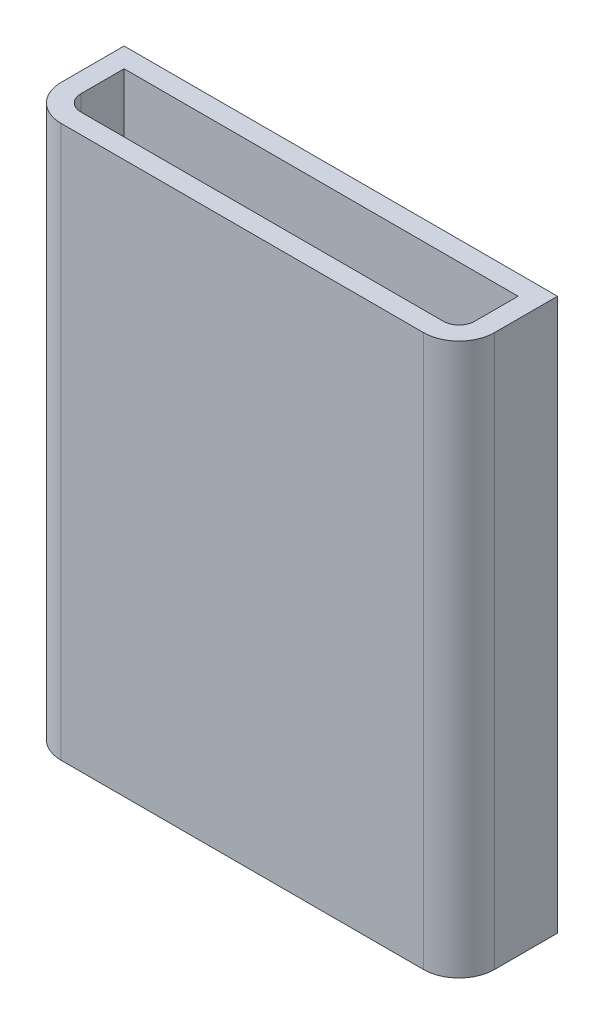
ISO-10303-21;
HEADER;
FILE_DESCRIPTION(('STEP AP214'),'2;1');
FILE_NAME('part.step','',(''),(''),'','','');
FILE_SCHEMA(('AUTOMOTIVE_DESIGN { 1 0 10303 214 1 1 1 1 }'));
ENDSEC;
DATA;
#1=APPLICATION_CONTEXT('core data for automotive mechanical design processes');
#2=APPLICATION_PROTOCOL_DEFINITION('international standard','automotive_design',2000,#1);
#3=PRODUCT_CONTEXT('',#1,'mechanical');
#4=PRODUCT('Part','Part','',(#3));
#5=PRODUCT_RELATED_PRODUCT_CATEGORY('part','',(#4));
#6=PRODUCT_DEFINITION_FORMATION('','',#4);
#7=PRODUCT_DEFINITION_CONTEXT('part definition',#1,'design');
#8=PRODUCT_DEFINITION('design','',#6,#7);
#9=PRODUCT_DEFINITION_SHAPE('','',#8);
#10=(LENGTH_UNIT() NAMED_UNIT(*) SI_UNIT(.MILLI.,.METRE.));
#11=(NAMED_UNIT(*) PLANE_ANGLE_UNIT() SI_UNIT($,.RADIAN.));
#12=(NAMED_UNIT(*) SI_UNIT($,.STERADIAN.) SOLID_ANGLE_UNIT());
#13=UNCERTAINTY_MEASURE_WITH_UNIT(LENGTH_MEASURE(1.E-05),#10,'distance_accuracy_value','');
#14=(GEOMETRIC_REPRESENTATION_CONTEXT(3) GLOBAL_UNCERTAINTY_ASSIGNED_CONTEXT((#13)) GLOBAL_UNIT_ASSIGNED_CONTEXT((#10,
#11,#12)) REPRESENTATION_CONTEXT('',''));
#15=CARTESIAN_POINT('',(0.,0.,0.));
#16=DIRECTION('',(0.,0.,1.));
#17=DIRECTION('',(1.,0.,0.));
#18=AXIS2_PLACEMENT_3D('',#15,#16,#17);
#19=CARTESIAN_POINT('',(-3.175,88.9,-6.985));
#20=DIRECTION('',(1.,0.,0.));
#21=DIRECTION('',(0.,0.,-1.));
#22=AXIS2_PLACEMENT_3D('',#19,#20,#21);
#23=PLANE('',#22);
#24=DIRECTION('',(0.,0.,1.));
#25=VECTOR('',#24,1.);
#26=CARTESIAN_POINT('',(-3.175,0.,-6.985));
#27=LINE('',#26,#25);
#28=CARTESIAN_POINT('',(-3.175,0.,-12.7));
#29=VERTEX_POINT('',#28);
#30=CARTESIAN_POINT('',(-3.175,0.,-2.54000000000002));
#31=VERTEX_POINT('',#30);
#32=EDGE_CURVE('E191',#29,#31,#27,.T.);
#33=ORIENTED_EDGE('',*,*,#32,.T.);
#34=DIRECTION('',(0.,-1.,0.));
#35=VECTOR('',#34,1.);
#36=CARTESIAN_POINT('',(-3.175,88.9,-2.54000000000002));
#37=LINE('',#36,#35);
#38=CARTESIAN_POINT('',(-3.175,88.9,-2.54000000000002));
#39=VERTEX_POINT('',#38);
#40=EDGE_CURVE('E51',#39,#31,#37,.T.);
#41=ORIENTED_EDGE('',*,*,#40,.F.);
#42=DIRECTION('',(0.,0.,1.));
#43=VECTOR('',#42,1.);
#44=CARTESIAN_POINT('',(-3.175,88.9,-12.7));
#45=LINE('',#44,#43);
#46=CARTESIAN_POINT('',(-3.175,88.9,-12.7));
#47=VERTEX_POINT('',#46);
#48=EDGE_CURVE('E207',#47,#39,#45,.T.);
#49=ORIENTED_EDGE('',*,*,#48,.F.);
#50=DIRECTION('',(0.,-1.,0.));
#51=VECTOR('',#50,1.);
#52=CARTESIAN_POINT('',(-3.175,88.9,-12.7));
#53=LINE('',#52,#51);
#54=EDGE_CURVE('E11',#47,#29,#53,.T.);
#55=ORIENTED_EDGE('',*,*,#54,.T.);
#56=EDGE_LOOP('',(#33,#41,#49,#55));
#57=FACE_BOUND('',#56,.T.);
#58=ADVANCED_FACE('F43',(#57),#23,.F.);
#59=CARTESIAN_POINT('',(2.54,88.9,-2.54));
#60=DIRECTION('',(0.,-1.,0.));
#61=DIRECTION('',(0.,0.,-1.));
#62=AXIS2_PLACEMENT_3D('',#59,#60,#61);
#63=CYLINDRICAL_SURFACE('',#62,5.715);
#64=CARTESIAN_POINT('',(2.54,0.,-2.54));
#65=DIRECTION('',(0.,1.,0.));
#66=DIRECTION('',(0.,0.,1.));
#67=AXIS2_PLACEMENT_3D('',#64,#65,#66);
#68=CIRCLE('',#67,5.715);
#69=CARTESIAN_POINT('',(2.54000000000004,0.,3.175));
#70=VERTEX_POINT('',#69);
#71=EDGE_CURVE('E226',#31,#70,#68,.T.);
#72=ORIENTED_EDGE('',*,*,#71,.T.);
#73=DIRECTION('',(0.,-1.,0.));
#74=VECTOR('',#73,1.);
#75=CARTESIAN_POINT('',(2.54000000000004,88.9,3.175));
#76=LINE('',#75,#74);
#77=CARTESIAN_POINT('',(2.54000000000004,88.9,3.175));
#78=VERTEX_POINT('',#77);
#79=EDGE_CURVE('E252',#78,#70,#76,.T.);
#80=ORIENTED_EDGE('',*,*,#79,.F.);
#81=CARTESIAN_POINT('',(2.54,88.9,-2.54));
#82=DIRECTION('',(0.,1.,0.));
#83=DIRECTION('',(0.,0.,1.));
#84=AXIS2_PLACEMENT_3D('',#81,#82,#83);
#85=CIRCLE('',#84,5.715);
#86=EDGE_CURVE('E211',#39,#78,#85,.T.);
#87=ORIENTED_EDGE('',*,*,#86,.F.);
#88=ORIENTED_EDGE('',*,*,#40,.T.);
#89=EDGE_LOOP('',(#72,#80,#87,#88));
#90=FACE_BOUND('',#89,.T.);
#91=ADVANCED_FACE('F261',(#90),#63,.T.);
#92=CARTESIAN_POINT('',(2.54000000000004,88.9,3.175));
#93=DIRECTION('',(0.,0.,-1.));
#94=DIRECTION('',(-1.,0.,0.));
#95=AXIS2_PLACEMENT_3D('',#92,#93,#94);
#96=PLANE('',#95);
#97=DIRECTION('',(1.,0.,0.));
#98=VECTOR('',#97,1.);
#99=CARTESIAN_POINT('',(2.54000000000004,0.,3.175));
#100=LINE('',#99,#98);
#101=CARTESIAN_POINT('',(60.96,0.,3.175));
#102=VERTEX_POINT('',#101);
#103=EDGE_CURVE('E229',#70,#102,#100,.T.);
#104=ORIENTED_EDGE('',*,*,#103,.T.);
#105=DIRECTION('',(0.,-1.,0.));
#106=VECTOR('',#105,1.);
#107=CARTESIAN_POINT('',(60.96,88.9,3.175));
#108=LINE('',#107,#106);
#109=CARTESIAN_POINT('',(60.96,88.9,3.175));
#110=VERTEX_POINT('',#109);
#111=EDGE_CURVE('E248',#110,#102,#108,.T.);
#112=ORIENTED_EDGE('',*,*,#111,.F.);
#113=DIRECTION('',(1.,0.,0.));
#114=VECTOR('',#113,1.);
#115=CARTESIAN_POINT('',(2.54000000000004,88.9,3.175));
#116=LINE('',#115,#114);
#117=EDGE_CURVE('E214',#78,#110,#116,.T.);
#118=ORIENTED_EDGE('',*,*,#117,.F.);
#119=ORIENTED_EDGE('',*,*,#79,.T.);
#120=EDGE_LOOP('',(#104,#112,#118,#119));
#121=FACE_BOUND('',#120,.T.);
#122=ADVANCED_FACE('F269',(#121),#96,.F.);
#123=CARTESIAN_POINT('',(60.96,88.9,-2.54));
#124=DIRECTION('',(0.,-1.,0.));
#125=DIRECTION('',(0.,0.,-1.));
#126=AXIS2_PLACEMENT_3D('',#123,#124,#125);
#127=CYLINDRICAL_SURFACE('',#126,5.715);
#128=CARTESIAN_POINT('',(60.96,0.,-2.54));
#129=DIRECTION('',(0.,1.,0.));
#130=DIRECTION('',(0.,0.,1.));
#131=AXIS2_PLACEMENT_3D('',#128,#129,#130);
#132=CIRCLE('',#131,5.715);
#133=CARTESIAN_POINT('',(66.675,0.,-2.54000000000004));
#134=VERTEX_POINT('',#133);
#135=EDGE_CURVE('E232',#102,#134,#132,.T.);
#136=ORIENTED_EDGE('',*,*,#135,.T.);
#137=DIRECTION('',(0.,-1.,0.));
#138=VECTOR('',#137,1.);
#139=CARTESIAN_POINT('',(66.675,88.9,-2.54000000000004));
#140=LINE('',#139,#138);
#141=CARTESIAN_POINT('',(66.675,88.9,-2.54000000000004));
#142=VERTEX_POINT('',#141);
#143=EDGE_CURVE('E244',#142,#134,#140,.T.);
#144=ORIENTED_EDGE('',*,*,#143,.F.);
#145=CARTESIAN_POINT('',(60.96,88.9,-2.54));
#146=DIRECTION('',(0.,1.,0.));
#147=DIRECTION('',(0.,0.,1.));
#148=AXIS2_PLACEMENT_3D('',#145,#146,#147);
#149=CIRCLE('',#148,5.715);
#150=EDGE_CURVE('E217',#110,#142,#149,.T.);
#151=ORIENTED_EDGE('',*,*,#150,.F.);
#152=ORIENTED_EDGE('',*,*,#111,.T.);
#153=EDGE_LOOP('',(#136,#144,#151,#152));
#154=FACE_BOUND('',#153,.T.);
#155=ADVANCED_FACE('F273',(#154),#127,.T.);
#156=CARTESIAN_POINT('',(66.675,88.9,-12.7));
#157=DIRECTION('',(1.,0.,0.));
#158=DIRECTION('',(0.,0.,-1.));
#159=AXIS2_PLACEMENT_3D('',#156,#157,#158);
#160=PLANE('',#159);
#161=DIRECTION('',(0.,0.,1.));
#162=VECTOR('',#161,1.);
#163=CARTESIAN_POINT('',(66.675,0.,-12.7));
#164=LINE('',#163,#162);
#165=CARTESIAN_POINT('',(66.675,0.,-12.7));
#166=VERTEX_POINT('',#165);
#167=EDGE_CURVE('E236',#166,#134,#164,.T.);
#168=ORIENTED_EDGE('',*,*,#167,.F.);
#169=DIRECTION('',(0.,-1.,0.));
#170=VECTOR('',#169,1.);
#171=CARTESIAN_POINT('',(66.675,88.9,-12.7));
#172=LINE('',#171,#170);
#173=CARTESIAN_POINT('',(66.675,88.9,-12.7));
#174=VERTEX_POINT('',#173);
#175=EDGE_CURVE('E223',#174,#166,#172,.T.);
#176=ORIENTED_EDGE('',*,*,#175,.F.);
#177=DIRECTION('',(0.,0.,-1.));
#178=VECTOR('',#177,1.);
#179=CARTESIAN_POINT('',(66.675,88.9,-2.54000000000004));
#180=LINE('',#179,#178);
#181=EDGE_CURVE('E220',#142,#174,#180,.T.);
#182=ORIENTED_EDGE('',*,*,#181,.F.);
#183=ORIENTED_EDGE('',*,*,#143,.T.);
#184=EDGE_LOOP('',(#168,#176,#182,#183));
#185=FACE_BOUND('',#184,.T.);
#186=ADVANCED_FACE('F285',(#185),#160,.T.);
#187=CARTESIAN_POINT('',(2.54,88.9,-12.7));
#188=DIRECTION('',(0.,0.,-1.));
#189=DIRECTION('',(-1.,0.,0.));
#190=AXIS2_PLACEMENT_3D('',#187,#188,#189);
#191=PLANE('',#190);
#192=DIRECTION('',(1.,0.,0.));
#193=VECTOR('',#192,1.);
#194=CARTESIAN_POINT('',(2.54,0.,-12.7));
#195=LINE('',#194,#193);
#196=EDGE_CURVE('E208',#29,#166,#195,.T.);
#197=ORIENTED_EDGE('',*,*,#196,.F.);
#198=ORIENTED_EDGE('',*,*,#54,.F.);
#199=DIRECTION('',(-1.,0.,0.));
#200=VECTOR('',#199,1.);
#201=CARTESIAN_POINT('',(2.54,88.9,-12.7));
#202=LINE('',#201,#200);
#203=EDGE_CURVE('E203',#174,#47,#202,.T.);
#204=ORIENTED_EDGE('',*,*,#203,.F.);
#205=ORIENTED_EDGE('',*,*,#175,.T.);
#206=EDGE_LOOP('',(#197,#198,#204,#205));
#207=FACE_BOUND('',#206,.T.);
#208=ADVANCED_FACE('F281',(#207),#191,.T.);
#209=CARTESIAN_POINT('',(2.54,88.9,-2.54));
#210=DIRECTION('',(0.,1.,0.));
#211=DIRECTION('',(0.,0.,1.));
#212=AXIS2_PLACEMENT_3D('',#209,#210,#211);
#213=PLANE('',#212);
#214=DIRECTION('',(0.,0.,1.));
#215=VECTOR('',#214,1.);
#216=CARTESIAN_POINT('',(0.,88.9,-9.525));
#217=LINE('',#216,#215);
#218=CARTESIAN_POINT('',(0.,88.9,-9.525));
#219=VERTEX_POINT('',#218);
#220=CARTESIAN_POINT('',(0.,88.9,-2.54000000000002));
#221=VERTEX_POINT('',#220);
#222=EDGE_CURVE('E136',#219,#221,#217,.T.);
#223=ORIENTED_EDGE('',*,*,#222,.F.);
#224=DIRECTION('',(-1.,0.,0.));
#225=VECTOR('',#224,1.);
#226=CARTESIAN_POINT('',(2.54,88.9,-9.525));
#227=LINE('',#226,#225);
#228=CARTESIAN_POINT('',(63.5,88.9,-9.525));
#229=VERTEX_POINT('',#228);
#230=EDGE_CURVE('E156',#229,#219,#227,.T.);
#231=ORIENTED_EDGE('',*,*,#230,.F.);
#232=DIRECTION('',(0.,0.,-1.));
#233=VECTOR('',#232,1.);
#234=CARTESIAN_POINT('',(63.5,88.9,-9.525));
#235=LINE('',#234,#233);
#236=CARTESIAN_POINT('',(63.5,88.9,-2.54));
#237=VERTEX_POINT('',#236);
#238=EDGE_CURVE('E181',#237,#229,#235,.T.);
#239=ORIENTED_EDGE('',*,*,#238,.F.);
#240=CARTESIAN_POINT('',(60.96,88.9,-2.54));
#241=DIRECTION('',(0.,1.,0.));
#242=DIRECTION('',(0.,0.,1.));
#243=AXIS2_PLACEMENT_3D('',#240,#241,#242);
#244=CIRCLE('',#243,2.54);
#245=CARTESIAN_POINT('',(60.96,88.9,0.));
#246=VERTEX_POINT('',#245);
#247=EDGE_CURVE('E177',#246,#237,#244,.T.);
#248=ORIENTED_EDGE('',*,*,#247,.F.);
#249=DIRECTION('',(1.,0.,0.));
#250=VECTOR('',#249,1.);
#251=CARTESIAN_POINT('',(2.54000000000002,88.9,0.));
#252=LINE('',#251,#250);
#253=CARTESIAN_POINT('',(2.54000000000002,88.9,0.));
#254=VERTEX_POINT('',#253);
#255=EDGE_CURVE('E173',#254,#246,#252,.T.);
#256=ORIENTED_EDGE('',*,*,#255,.F.);
#257=CARTESIAN_POINT('',(2.54,88.9,-2.54));
#258=DIRECTION('',(0.,1.,0.));
#259=DIRECTION('',(0.,0.,1.));
#260=AXIS2_PLACEMENT_3D('',#257,#258,#259);
#261=CIRCLE('',#260,2.54);
#262=EDGE_CURVE('E170',#221,#254,#261,.T.);
#263=ORIENTED_EDGE('',*,*,#262,.F.);
#264=EDGE_LOOP('',(#223,#231,#239,#248,#256,#263));
#265=FACE_BOUND('',#264,.T.);
#266=ORIENTED_EDGE('',*,*,#203,.T.);
#267=ORIENTED_EDGE('',*,*,#48,.T.);
#268=ORIENTED_EDGE('',*,*,#86,.T.);
#269=ORIENTED_EDGE('',*,*,#117,.T.);
#270=ORIENTED_EDGE('',*,*,#150,.T.);
#271=ORIENTED_EDGE('',*,*,#181,.T.);
#272=EDGE_LOOP('',(#266,#267,#268,#269,#270,#271));
#273=FACE_BOUND('',#272,.T.);
#274=ADVANCED_FACE('F277',(#265,#273),#213,.T.);
#275=CARTESIAN_POINT('',(2.54,0.,-2.54));
#276=DIRECTION('',(0.,1.,0.));
#277=DIRECTION('',(0.,0.,1.));
#278=AXIS2_PLACEMENT_3D('',#275,#276,#277);
#279=PLANE('',#278);
#280=DIRECTION('',(-1.,0.,0.));
#281=VECTOR('',#280,1.);
#282=CARTESIAN_POINT('',(60.96,0.,-9.525));
#283=LINE('',#282,#281);
#284=CARTESIAN_POINT('',(63.5,0.,-9.525));
#285=VERTEX_POINT('',#284);
#286=CARTESIAN_POINT('',(0.,0.,-9.525));
#287=VERTEX_POINT('',#286);
#288=EDGE_CURVE('E140',#285,#287,#283,.T.);
#289=ORIENTED_EDGE('',*,*,#288,.T.);
#290=DIRECTION('',(0.,0.,1.));
#291=VECTOR('',#290,1.);
#292=CARTESIAN_POINT('',(0.,0.,-6.985));
#293=LINE('',#292,#291);
#294=CARTESIAN_POINT('',(0.,0.,-2.54000000000002));
#295=VERTEX_POINT('',#294);
#296=EDGE_CURVE('E133',#287,#295,#293,.T.);
#297=ORIENTED_EDGE('',*,*,#296,.T.);
#298=CARTESIAN_POINT('',(2.54,0.,-2.54));
#299=DIRECTION('',(0.,1.,0.));
#300=DIRECTION('',(0.,0.,1.));
#301=AXIS2_PLACEMENT_3D('',#298,#299,#300);
#302=CIRCLE('',#301,2.54);
#303=CARTESIAN_POINT('',(2.54,0.,0.));
#304=VERTEX_POINT('',#303);
#305=EDGE_CURVE('E143',#295,#304,#302,.T.);
#306=ORIENTED_EDGE('',*,*,#305,.T.);
#307=DIRECTION('',(1.,0.,0.));
#308=VECTOR('',#307,1.);
#309=CARTESIAN_POINT('',(2.54000000000002,0.,0.));
#310=LINE('',#309,#308);
#311=CARTESIAN_POINT('',(60.96,0.,0.));
#312=VERTEX_POINT('',#311);
#313=EDGE_CURVE('E66',#304,#312,#310,.T.);
#314=ORIENTED_EDGE('',*,*,#313,.T.);
#315=CARTESIAN_POINT('',(60.96,0.,-2.54));
#316=DIRECTION('',(0.,1.,0.));
#317=DIRECTION('',(0.,0.,1.));
#318=AXIS2_PLACEMENT_3D('',#315,#316,#317);
#319=CIRCLE('',#318,2.54);
#320=CARTESIAN_POINT('',(63.5,0.,-2.54));
#321=VERTEX_POINT('',#320);
#322=EDGE_CURVE('E161',#312,#321,#319,.T.);
#323=ORIENTED_EDGE('',*,*,#322,.T.);
#324=DIRECTION('',(0.,0.,-1.));
#325=VECTOR('',#324,1.);
#326=CARTESIAN_POINT('',(63.5,0.,-2.54));
#327=LINE('',#326,#325);
#328=EDGE_CURVE('E165',#321,#285,#327,.T.);
#329=ORIENTED_EDGE('',*,*,#328,.T.);
#330=EDGE_LOOP('',(#289,#297,#306,#314,#323,#329));
#331=FACE_BOUND('',#330,.T.);
#332=ORIENTED_EDGE('',*,*,#32,.F.);
#333=ORIENTED_EDGE('',*,*,#196,.T.);
#334=ORIENTED_EDGE('',*,*,#167,.T.);
#335=ORIENTED_EDGE('',*,*,#135,.F.);
#336=ORIENTED_EDGE('',*,*,#103,.F.);
#337=ORIENTED_EDGE('',*,*,#71,.F.);
#338=EDGE_LOOP('',(#332,#333,#334,#335,#336,#337));
#339=FACE_BOUND('',#338,.T.);
#340=ADVANCED_FACE('F149',(#331,#339),#279,.F.);
#341=CARTESIAN_POINT('',(0.,0.,-9.525));
#342=DIRECTION('',(-1.,0.,0.));
#343=DIRECTION('',(0.,0.,1.));
#344=AXIS2_PLACEMENT_3D('',#341,#342,#343);
#345=PLANE('',#344);
#346=ORIENTED_EDGE('',*,*,#222,.T.);
#347=DIRECTION('',(0.,1.,0.));
#348=VECTOR('',#347,1.);
#349=CARTESIAN_POINT('',(0.,0.,-2.54000000000002));
#350=LINE('',#349,#348);
#351=EDGE_CURVE('E58',#295,#221,#350,.T.);
#352=ORIENTED_EDGE('',*,*,#351,.F.);
#353=ORIENTED_EDGE('',*,*,#296,.F.);
#354=DIRECTION('',(0.,1.,0.));
#355=VECTOR('',#354,1.);
#356=CARTESIAN_POINT('',(0.,0.,-9.525));
#357=LINE('',#356,#355);
#358=EDGE_CURVE('E188',#287,#219,#357,.T.);
#359=ORIENTED_EDGE('',*,*,#358,.T.);
#360=EDGE_LOOP('',(#346,#352,#353,#359));
#361=FACE_BOUND('',#360,.T.);
#362=ADVANCED_FACE('F131',(#361),#345,.F.);
#363=CARTESIAN_POINT('',(2.54,0.,-9.525));
#364=DIRECTION('',(0.,0.,-1.));
#365=DIRECTION('',(-1.,0.,0.));
#366=AXIS2_PLACEMENT_3D('',#363,#364,#365);
#367=PLANE('',#366);
#368=ORIENTED_EDGE('',*,*,#230,.T.);
#369=ORIENTED_EDGE('',*,*,#358,.F.);
#370=ORIENTED_EDGE('',*,*,#288,.F.);
#371=DIRECTION('',(0.,1.,0.));
#372=VECTOR('',#371,1.);
#373=CARTESIAN_POINT('',(63.5,0.,-9.525));
#374=LINE('',#373,#372);
#375=EDGE_CURVE('E192',#285,#229,#374,.T.);
#376=ORIENTED_EDGE('',*,*,#375,.T.);
#377=EDGE_LOOP('',(#368,#369,#370,#376));
#378=FACE_BOUND('',#377,.T.);
#379=ADVANCED_FACE('F351',(#378),#367,.F.);
#380=CARTESIAN_POINT('',(63.5,0.,-9.525));
#381=DIRECTION('',(1.,0.,0.));
#382=DIRECTION('',(0.,0.,-1.));
#383=AXIS2_PLACEMENT_3D('',#380,#381,#382);
#384=PLANE('',#383);
#385=ORIENTED_EDGE('',*,*,#238,.T.);
#386=ORIENTED_EDGE('',*,*,#375,.F.);
#387=ORIENTED_EDGE('',*,*,#328,.F.);
#388=DIRECTION('',(0.,1.,0.));
#389=VECTOR('',#388,1.);
#390=CARTESIAN_POINT('',(63.5,0.,-2.54));
#391=LINE('',#390,#389);
#392=EDGE_CURVE('E195',#321,#237,#391,.T.);
#393=ORIENTED_EDGE('',*,*,#392,.T.);
#394=EDGE_LOOP('',(#385,#386,#387,#393));
#395=FACE_BOUND('',#394,.T.);
#396=ADVANCED_FACE('F361',(#395),#384,.F.);
#397=CARTESIAN_POINT('',(60.96,0.,-2.54));
#398=DIRECTION('',(0.,1.,0.));
#399=DIRECTION('',(0.,0.,1.));
#400=AXIS2_PLACEMENT_3D('',#397,#398,#399);
#401=CYLINDRICAL_SURFACE('',#400,2.54);
#402=ORIENTED_EDGE('',*,*,#247,.T.);
#403=ORIENTED_EDGE('',*,*,#392,.F.);
#404=ORIENTED_EDGE('',*,*,#322,.F.);
#405=DIRECTION('',(0.,1.,0.));
#406=VECTOR('',#405,1.);
#407=CARTESIAN_POINT('',(60.96,0.,0.));
#408=LINE('',#407,#406);
#409=EDGE_CURVE('E198',#312,#246,#408,.T.);
#410=ORIENTED_EDGE('',*,*,#409,.T.);
#411=EDGE_LOOP('',(#402,#403,#404,#410));
#412=FACE_BOUND('',#411,.T.);
#413=ADVANCED_FACE('F373',(#412),#401,.F.);
#414=CARTESIAN_POINT('',(2.54000000000002,0.,0.));
#415=DIRECTION('',(0.,0.,1.));
#416=DIRECTION('',(1.,0.,0.));
#417=AXIS2_PLACEMENT_3D('',#414,#415,#416);
#418=PLANE('',#417);
#419=ORIENTED_EDGE('',*,*,#255,.T.);
#420=ORIENTED_EDGE('',*,*,#409,.F.);
#421=ORIENTED_EDGE('',*,*,#313,.F.);
#422=DIRECTION('',(0.,1.,0.));
#423=VECTOR('',#422,1.);
#424=CARTESIAN_POINT('',(2.54000000000002,0.,0.));
#425=LINE('',#424,#423);
#426=EDGE_CURVE('E139',#304,#254,#425,.T.);
#427=ORIENTED_EDGE('',*,*,#426,.T.);
#428=EDGE_LOOP('',(#419,#420,#421,#427));
#429=FACE_BOUND('',#428,.T.);
#430=ADVANCED_FACE('F383',(#429),#418,.F.);
#431=CARTESIAN_POINT('',(2.54,0.,-2.54));
#432=DIRECTION('',(0.,1.,0.));
#433=DIRECTION('',(0.,0.,1.));
#434=AXIS2_PLACEMENT_3D('',#431,#432,#433);
#435=CYLINDRICAL_SURFACE('',#434,2.54);
#436=ORIENTED_EDGE('',*,*,#262,.T.);
#437=ORIENTED_EDGE('',*,*,#426,.F.);
#438=ORIENTED_EDGE('',*,*,#305,.F.);
#439=ORIENTED_EDGE('',*,*,#351,.T.);
#440=EDGE_LOOP('',(#436,#437,#438,#439));
#441=FACE_BOUND('',#440,.T.);
#442=ADVANCED_FACE('F144',(#441),#435,.F.);
#443=CLOSED_SHELL('',(#58,#91,#122,#155,#186,#208,#274,#340,#362,#379,#396,#413,#430,#442));
#444=MANIFOLD_SOLID_BREP('B2',#443);
#445=ADVANCED_BREP_SHAPE_REPRESENTATION('',(#18,#444),#14);
#446=SHAPE_DEFINITION_REPRESENTATION(#9,#445);
ENDSEC;
END-ISO-10303-21;
